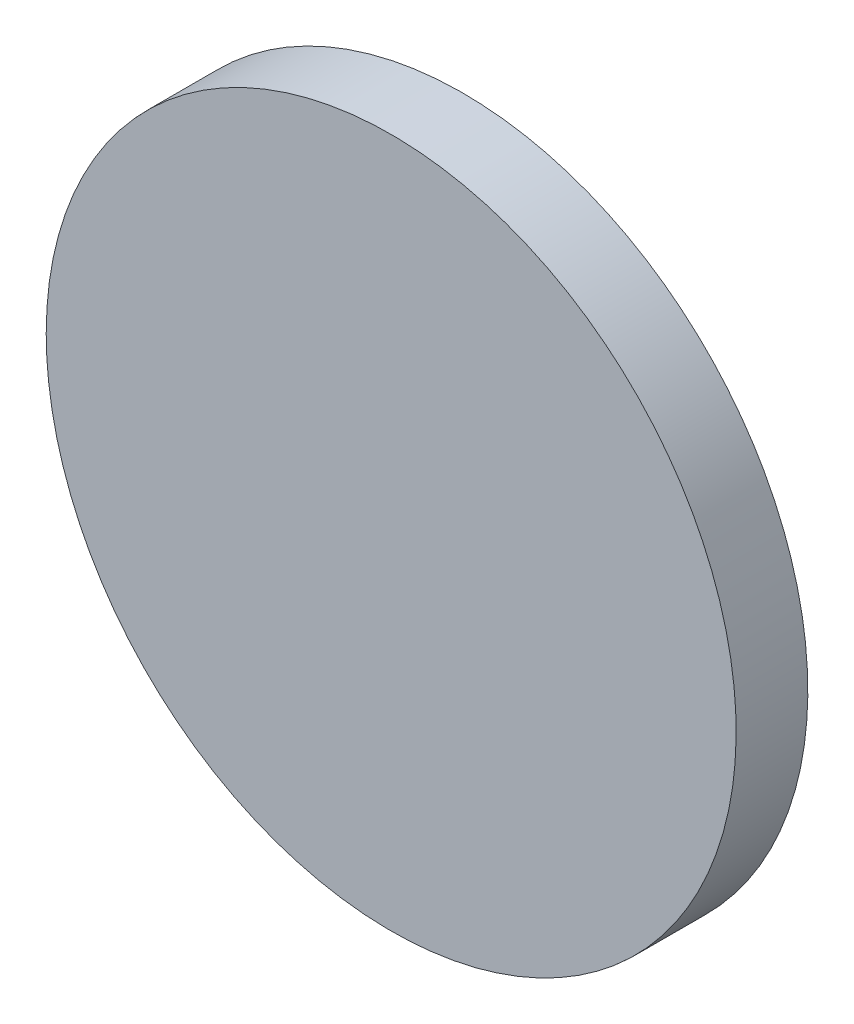
ISO-10303-21;
HEADER;
FILE_DESCRIPTION(('STEP AP214'),'2;1');
FILE_NAME('part.step','',(''),(''),'','','');
FILE_SCHEMA(('AUTOMOTIVE_DESIGN { 1 0 10303 214 1 1 1 1 }'));
ENDSEC;
DATA;
#1=APPLICATION_CONTEXT('core data for automotive mechanical design processes');
#2=APPLICATION_PROTOCOL_DEFINITION('international standard','automotive_design',2000,#1);
#3=PRODUCT_CONTEXT('',#1,'mechanical');
#4=PRODUCT('Part','Part','',(#3));
#5=PRODUCT_RELATED_PRODUCT_CATEGORY('part','',(#4));
#6=PRODUCT_DEFINITION_FORMATION('','',#4);
#7=PRODUCT_DEFINITION_CONTEXT('part definition',#1,'design');
#8=PRODUCT_DEFINITION('design','',#6,#7);
#9=PRODUCT_DEFINITION_SHAPE('','',#8);
#10=(LENGTH_UNIT() NAMED_UNIT(*) SI_UNIT(.MILLI.,.METRE.));
#11=(NAMED_UNIT(*) PLANE_ANGLE_UNIT() SI_UNIT($,.RADIAN.));
#12=(NAMED_UNIT(*) SI_UNIT($,.STERADIAN.) SOLID_ANGLE_UNIT());
#13=UNCERTAINTY_MEASURE_WITH_UNIT(LENGTH_MEASURE(1.E-05),#10,'distance_accuracy_value','');
#14=(GEOMETRIC_REPRESENTATION_CONTEXT(3) GLOBAL_UNCERTAINTY_ASSIGNED_CONTEXT((#13)) GLOBAL_UNIT_ASSIGNED_CONTEXT((#10,
#11,#12)) REPRESENTATION_CONTEXT('',''));
#15=CARTESIAN_POINT('',(0.,0.,0.));
#16=DIRECTION('',(0.,0.,1.));
#17=DIRECTION('',(1.,0.,0.));
#18=AXIS2_PLACEMENT_3D('',#15,#16,#17);
#19=CARTESIAN_POINT('',(-39.1301803038668,-4.71707895126184,92.5012));
#20=CARTESIAN_POINT('',(-39.1301803038668,-3.14225523024903,92.5012));
#21=CARTESIAN_POINT('',(-38.8199671072213,0.00739221177660808,92.5012));
#22=CARTESIAN_POINT('',(-37.4418897010833,4.55030459753344,92.5012));
#23=CARTESIAN_POINT('',(-35.2040134256585,8.73707663071864,92.5012));
#24=CARTESIAN_POINT('',(-32.192338611196,12.4068130100657,92.5012));
#25=CARTESIAN_POINT('',(-28.5226022318489,15.4184878245282,92.5012));
#26=CARTESIAN_POINT('',(-24.3358301986637,17.656364099953,92.5012));
#27=CARTESIAN_POINT('',(-19.7929178129069,19.0344415060911,92.5012));
#28=CARTESIAN_POINT('',(-15.0684466498684,19.4997613010592,92.5012));
#29=CARTESIAN_POINT('',(-10.34397548683,19.0344415060911,92.5012));
#30=CARTESIAN_POINT('',(-5.80106310107313,17.656364099953,92.5012));
#31=CARTESIAN_POINT('',(-1.61429106788792,15.4184878245282,92.5012));
#32=CARTESIAN_POINT('',(2.05544531145914,12.4068130100657,92.5012));
#33=CARTESIAN_POINT('',(5.06712012592165,8.73707663071865,92.5012));
#34=CARTESIAN_POINT('',(7.30499640134647,4.55030459753344,92.5012));
#35=CARTESIAN_POINT('',(8.68307380748453,0.00739221177661997,92.5012));
#36=CARTESIAN_POINT('',(9.14839360245264,-4.71707895126184,92.5012));
#37=CARTESIAN_POINT('',(8.68307380748453,-9.4415501143003,92.5012));
#38=CARTESIAN_POINT('',(7.30499640134648,-13.9844625000571,92.5012));
#39=CARTESIAN_POINT('',(5.06712012592165,-18.1712345332423,92.5012));
#40=CARTESIAN_POINT('',(2.05544531145915,-21.8409709125894,92.5012));
#41=CARTESIAN_POINT('',(-1.61429106788792,-24.8526457270519,92.5012));
#42=CARTESIAN_POINT('',(-5.80106310107311,-27.0905220024767,92.5012));
#43=CARTESIAN_POINT('',(-10.34397548683,-28.4685994086148,92.5012));
#44=CARTESIAN_POINT('',(-15.0684466498684,-28.9339192035829,92.5012));
#45=CARTESIAN_POINT('',(-19.7929178129069,-28.4685994086148,92.5012));
#46=CARTESIAN_POINT('',(-24.3358301986637,-27.0905220024767,92.5012));
#47=CARTESIAN_POINT('',(-28.5226022318489,-24.8526457270519,92.5012));
#48=CARTESIAN_POINT('',(-32.192338611196,-21.8409709125894,92.5012));
#49=CARTESIAN_POINT('',(-35.2040134256584,-18.1712345332423,92.5012));
#50=CARTESIAN_POINT('',(-37.4418897010833,-13.9844625000571,92.5012));
#51=CARTESIAN_POINT('',(-38.8199671072213,-9.44155011430031,92.5012));
#52=CARTESIAN_POINT('',(-39.1301803038668,-6.29190267227467,92.5012));
#53=CARTESIAN_POINT('',(-39.1301803038668,-4.71707895126184,92.5012));
#54=B_SPLINE_CURVE_WITH_KNOTS('',3,(#19,#20,#21,#22,#23,#24,#25,#26,#27,#28,#29,#30,#31,#32,#33,
#34,#35,#36,#37,#38,#39,#40,#41,#42,#43,#44,#45,#46,#47,#48,#49,#50,#51,#52,#53),.UNSPECIFIED.,
.T.,.F.,(4,1,1,1,1,1,1,1,1,1,1,1,1,1,1,1,1,1,1,1,1,1,1,1,1,1,1,1,1,1,1,1,4),(0.,0.03125,0.0625,
0.09375,0.125,0.15625,0.1875,0.21875,0.25,0.28125,0.3125,0.34375,0.375,0.40625,0.4375,0.46875,
0.5,0.53125,0.5625,0.59375,0.625,0.65625,0.6875,0.71875,0.75,0.78125,0.8125,0.84375,0.875,
0.90625,0.9375,0.96875,1.),.UNSPECIFIED.);
#55=DIRECTION('',(0.,0.,-1.));
#56=VECTOR('',#55,1.);
#57=SURFACE_OF_LINEAR_EXTRUSION('',#54,#56);
#58=CARTESIAN_POINT('',(-39.1301803038668,-4.71707895126184,92.5012));
#59=CARTESIAN_POINT('',(-39.1301803038668,-3.14225523024903,92.5012));
#60=CARTESIAN_POINT('',(-38.8199671072213,0.00739221177660808,92.5012));
#61=CARTESIAN_POINT('',(-37.4418897010833,4.55030459753344,92.5012));
#62=CARTESIAN_POINT('',(-35.2040134256585,8.73707663071864,92.5012));
#63=CARTESIAN_POINT('',(-32.192338611196,12.4068130100657,92.5012));
#64=CARTESIAN_POINT('',(-28.5226022318489,15.4184878245282,92.5012));
#65=CARTESIAN_POINT('',(-24.3358301986637,17.656364099953,92.5012));
#66=CARTESIAN_POINT('',(-19.7929178129069,19.0344415060911,92.5012));
#67=CARTESIAN_POINT('',(-15.0684466498684,19.4997613010592,92.5012));
#68=CARTESIAN_POINT('',(-10.34397548683,19.0344415060911,92.5012));
#69=CARTESIAN_POINT('',(-5.80106310107313,17.656364099953,92.5012));
#70=CARTESIAN_POINT('',(-1.61429106788792,15.4184878245282,92.5012));
#71=CARTESIAN_POINT('',(2.05544531145914,12.4068130100657,92.5012));
#72=CARTESIAN_POINT('',(5.06712012592165,8.73707663071865,92.5012));
#73=CARTESIAN_POINT('',(7.30499640134647,4.55030459753344,92.5012));
#74=CARTESIAN_POINT('',(8.68307380748453,0.00739221177661997,92.5012));
#75=CARTESIAN_POINT('',(9.14839360245264,-4.71707895126184,92.5012));
#76=CARTESIAN_POINT('',(8.68307380748453,-9.4415501143003,92.5012));
#77=CARTESIAN_POINT('',(7.30499640134648,-13.9844625000571,92.5012));
#78=CARTESIAN_POINT('',(5.06712012592165,-18.1712345332423,92.5012));
#79=CARTESIAN_POINT('',(2.05544531145915,-21.8409709125894,92.5012));
#80=CARTESIAN_POINT('',(-1.61429106788792,-24.8526457270519,92.5012));
#81=CARTESIAN_POINT('',(-5.80106310107311,-27.0905220024767,92.5012));
#82=CARTESIAN_POINT('',(-10.34397548683,-28.4685994086148,92.5012));
#83=CARTESIAN_POINT('',(-15.0684466498684,-28.9339192035829,92.5012));
#84=CARTESIAN_POINT('',(-19.7929178129069,-28.4685994086148,92.5012));
#85=CARTESIAN_POINT('',(-24.3358301986637,-27.0905220024767,92.5012));
#86=CARTESIAN_POINT('',(-28.5226022318489,-24.8526457270519,92.5012));
#87=CARTESIAN_POINT('',(-32.192338611196,-21.8409709125894,92.5012));
#88=CARTESIAN_POINT('',(-35.2040134256584,-18.1712345332423,92.5011999999999));
#89=CARTESIAN_POINT('',(-37.4418897010833,-13.9844625000571,92.5012));
#90=CARTESIAN_POINT('',(-38.8199671072213,-9.44155011430031,92.5012));
#91=CARTESIAN_POINT('',(-39.1301803038668,-6.29190267227467,92.5012));
#92=CARTESIAN_POINT('',(-39.1301803038668,-4.71707895126184,92.5012));
#93=B_SPLINE_CURVE_WITH_KNOTS('',3,(#58,#59,#60,#61,#62,#63,#64,#65,#66,#67,#68,#69,#70,#71,#72,
#73,#74,#75,#76,#77,#78,#79,#80,#81,#82,#83,#84,#85,#86,#87,#88,#89,#90,#91,#92),.UNSPECIFIED.,
.T.,.F.,(4,1,1,1,1,1,1,1,1,1,1,1,1,1,1,1,1,1,1,1,1,1,1,1,1,1,1,1,1,1,1,1,4),(0.,0.03125,0.0625,
0.09375,0.125,0.15625,0.1875,0.21875,0.25,0.28125,0.3125,0.34375,0.375,0.40625,0.4375,0.46875,
0.5,0.53125,0.5625,0.59375,0.625,0.65625,0.6875,0.71875,0.75,0.78125,0.8125,0.84375,0.875,
0.90625,0.9375,0.96875,1.),.UNSPECIFIED.);
#94=CARTESIAN_POINT('',(-39.1301803038668,-4.71707895126184,92.5012));
#95=VERTEX_POINT('',#94);
#96=EDGE_CURVE('E10',#95,#95,#93,.T.);
#97=ORIENTED_EDGE('',*,*,#96,.T.);
#98=EDGE_LOOP('',(#97));
#99=FACE_BOUND('',#98,.T.);
#100=CARTESIAN_POINT('',(-39.1301803038668,-4.71707895126184,87.5012));
#101=CARTESIAN_POINT('',(-39.1301802222032,-5.1107872990119,87.5012));
#102=CARTESIAN_POINT('',(-39.1204860256992,-5.50449278140269,87.5012));
#103=CARTESIAN_POINT('',(-39.0818025927257,-6.29095813858405,87.5012));
#104=CARTESIAN_POINT('',(-39.0528132063749,-6.68371800600549,87.5012));
#105=CARTESIAN_POINT('',(-38.9756325863231,-7.46734611050324,87.5012));
#106=CARTESIAN_POINT('',(-38.9274413526221,-7.85821434757955,87.5012));
#107=CARTESIAN_POINT('',(-38.8119495875981,-8.63711557124963,87.5012));
#108=CARTESIAN_POINT('',(-38.7446492047158,-9.02514857984355,87.5012));
#109=CARTESIAN_POINT('',(-38.5910324726703,-9.79743205632982,87.5012));
#110=CARTESIAN_POINT('',(-38.5047161235071,-10.1816825242222,87.5012));
#111=CARTESIAN_POINT('',(-38.3133439864091,-10.9454902631069,87.5012));
#112=CARTESIAN_POINT('',(-38.2082880529137,-11.3250474976198,87.5012));
#113=CARTESIAN_POINT('',(-37.9797122353719,-12.0785609863271,87.5012));
#114=CARTESIAN_POINT('',(-37.8561923513257,-12.4525172405214,87.5012));
#115=CARTESIAN_POINT('',(-37.5909636221545,-13.1939208314435,87.5012));
#116=CARTESIAN_POINT('',(-37.4492549183258,-13.5613682187089,87.5012));
#117=CARTESIAN_POINT('',(-37.1479248607452,-14.2888433305481,87.5012));
#118=CARTESIAN_POINT('',(-36.9883035069933,-14.6488710551219,87.5012));
#119=CARTESIAN_POINT('',(-36.6515970329992,-15.3606675950413,87.5012));
#120=CARTESIAN_POINT('',(-36.4745117771101,-15.7124363462109,87.5012));
#121=CARTESIAN_POINT('',(-36.1033247909515,-16.4068783534881,87.5012));
#122=CARTESIAN_POINT('',(-35.909223060682,-16.7495516095956,87.5012));
#123=CARTESIAN_POINT('',(-35.5044499617942,-17.4249657805452,87.5012));
#124=CARTESIAN_POINT('',(-35.2937787218976,-17.7577067725192,87.5011999999999));
#125=CARTESIAN_POINT('',(-34.8563152830734,-18.4124170760193,87.5011999999999));
#126=CARTESIAN_POINT('',(-34.6295230841459,-18.7343863875453,87.5012));
#127=CARTESIAN_POINT('',(-34.1604217144475,-19.3668177821266,87.5012));
#128=CARTESIAN_POINT('',(-33.9181124231562,-19.6772797757756,87.5012));
#129=CARTESIAN_POINT('',(-33.4185787760349,-20.2859632859427,87.5012));
#130=CARTESIAN_POINT('',(-33.1613544202049,-20.5841848024609,87.5012));
#131=CARTESIAN_POINT('',(-32.6325921548073,-21.1676537653001,87.5012));
#132=CARTESIAN_POINT('',(-32.3610543564404,-21.4529013123835,87.5012));
#133=CARTESIAN_POINT('',(-31.8042690109901,-22.0096866578338,87.5012));
#134=CARTESIAN_POINT('',(-31.5190214639067,-22.2812244562007,87.5012));
#135=CARTESIAN_POINT('',(-30.9355525010675,-22.8099867215983,87.5012));
#136=CARTESIAN_POINT('',(-30.6373309845493,-23.0672110774283,87.5012));
#137=CARTESIAN_POINT('',(-30.0286474743822,-23.5667447245496,87.5012));
#138=CARTESIAN_POINT('',(-29.7181854807333,-23.8090540158409,87.5012));
#139=CARTESIAN_POINT('',(-29.0857540861519,-24.2781553855393,87.5012));
#140=CARTESIAN_POINT('',(-28.7637847746257,-24.5049475844669,87.5012));
#141=CARTESIAN_POINT('',(-28.1090744711261,-24.942411023291,87.5012));
#142=CARTESIAN_POINT('',(-27.7763334791526,-25.1530822631876,87.5012));
#143=CARTESIAN_POINT('',(-27.1009193082014,-25.5578553620755,87.5012));
#144=CARTESIAN_POINT('',(-26.7582460520915,-25.7519570923451,87.5012));
#145=CARTESIAN_POINT('',(-26.0638040448207,-26.1231440785033,87.5012));
#146=CARTESIAN_POINT('',(-25.7120352936597,-26.3002293343921,87.5012));
#147=CARTESIAN_POINT('',(-25.0002387537167,-26.6369358083873,87.5012));
#148=CARTESIAN_POINT('',(-24.6402110291108,-26.7965571621408,87.5012));
#149=CARTESIAN_POINT('',(-23.9127359173595,-27.097887219717,87.5012));
#150=CARTESIAN_POINT('',(-23.5452885302142,-27.2395959235398,87.5012));
#151=CARTESIAN_POINT('',(-22.803884938964,-27.5048246527272,87.5012));
#152=CARTESIAN_POINT('',(-22.4299286843214,-27.6283445367956,87.5012));
#153=CARTESIAN_POINT('',(-21.6764151968387,-27.8569203542769,87.5012));
#154=CARTESIAN_POINT('',(-21.2968579639985,-27.9619762876898,87.5012));
#155=CARTESIAN_POINT('',(-20.5330502205438,-28.1533484250133,87.5012));
#156=CARTESIAN_POINT('',(-20.1487997464088,-28.2396647744847,87.5012));
#157=CARTESIAN_POINT('',(-19.3765162869778,-28.3932815056882,87.5012));
#158=CARTESIAN_POINT('',(-18.9884833016818,-28.4605818874205,87.5012));
#159=CARTESIAN_POINT('',(-18.2095820143604,-28.5760736555866,87.5012));
#160=CARTESIAN_POINT('',(-17.8187136903339,-28.6242648935798,87.5012));
#161=CARTESIAN_POINT('',(-17.035085823388,-28.7014455019051,87.5012));
#162=CARTESIAN_POINT('',(-16.6423262804685,-28.7304348722371,87.5012));
#163=CARTESIAN_POINT('',(-15.8558600367348,-28.7691183489744,87.5012));
#164=CARTESIAN_POINT('',(-15.4621533433016,-28.7788126052602,87.5012));
#165=CARTESIAN_POINT('',(-14.6747399564352,-28.7788126052602,87.5012));
#166=CARTESIAN_POINT('',(-14.281033263002,-28.7691183489744,87.5012));
#167=CARTESIAN_POINT('',(-13.4945670192683,-28.7304348722371,87.5012));
#168=CARTESIAN_POINT('',(-13.1018074763489,-28.7014455019051,87.5012));
#169=CARTESIAN_POINT('',(-12.318179609403,-28.6242648935798,87.5012));
#170=CARTESIAN_POINT('',(-11.9273112853765,-28.5760736555866,87.5012));
#171=CARTESIAN_POINT('',(-11.1484099980551,-28.4605818874205,87.5012));
#172=CARTESIAN_POINT('',(-10.7603770127591,-28.3932815056882,87.5012));
#173=CARTESIAN_POINT('',(-9.98809355332808,-28.2396647744847,87.5012));
#174=CARTESIAN_POINT('',(-9.60384307919307,-28.1533484250133,87.5012));
#175=CARTESIAN_POINT('',(-8.8400353357384,-27.9619762876898,87.5012));
#176=CARTESIAN_POINT('',(-8.46047810289821,-27.8569203542769,87.5012));
#177=CARTESIAN_POINT('',(-7.70696461541547,-27.6283445367956,87.5012));
#178=CARTESIAN_POINT('',(-7.33300836077292,-27.5048246527272,87.5012));
#179=CARTESIAN_POINT('',(-6.59160476952266,-27.2395959235398,87.5012));
#180=CARTESIAN_POINT('',(-6.22415738237737,-27.0978872197171,87.5012));
#181=CARTESIAN_POINT('',(-5.49668227062612,-26.7965571621408,87.5012));
#182=CARTESIAN_POINT('',(-5.13665454602016,-26.6369358083873,87.5012));
#183=CARTESIAN_POINT('',(-4.42485800607718,-26.3002293343921,87.5012));
#184=CARTESIAN_POINT('',(-4.07308925491617,-26.1231440785034,87.5012));
#185=CARTESIAN_POINT('',(-3.37864724764532,-25.7519570923451,87.5012));
#186=CARTESIAN_POINT('',(-3.03597399153548,-25.5578553620755,87.5012));
#187=CARTESIAN_POINT('',(-2.36055982058423,-25.1530822631876,87.5012));
#188=CARTESIAN_POINT('',(-2.02781882861078,-24.942411023291,87.5012));
#189=CARTESIAN_POINT('',(-1.37310852511114,-24.5049475844669,87.5012));
#190=CARTESIAN_POINT('',(-1.05113921358496,-24.2781553855394,87.5012));
#191=CARTESIAN_POINT('',(-0.418707819003584,-23.8090540158409,87.5012));
#192=CARTESIAN_POINT('',(-0.108245825354678,-23.5667447245496,87.5012));
#193=CARTESIAN_POINT('',(0.500437684812428,-23.0672110774283,87.5012));
#194=CARTESIAN_POINT('',(0.798659201330628,-22.8099867215983,87.5012));
#195=CARTESIAN_POINT('',(1.38212816416985,-22.2812244562007,87.5012));
#196=CARTESIAN_POINT('',(1.66737571125323,-22.0096866578338,87.5012));
#197=CARTESIAN_POINT('',(2.22416105670352,-21.4529013123835,87.5012));
#198=CARTESIAN_POINT('',(2.49569885507044,-21.1676537653001,87.5012));
#199=CARTESIAN_POINT('',(3.02446112046807,-20.5841848024609,87.5012));
#200=CARTESIAN_POINT('',(3.28168547629803,-20.2859632859427,87.5012));
#201=CARTESIAN_POINT('',(3.78121912341932,-19.6772797757756,87.5012));
#202=CARTESIAN_POINT('',(4.02352841471064,-19.3668177821267,87.5012));
#203=CARTESIAN_POINT('',(4.49262978440909,-18.7343863875453,87.5012));
#204=CARTESIAN_POINT('',(4.71942198333663,-18.4124170760191,87.5012));
#205=CARTESIAN_POINT('',(5.15688542216075,-17.7577067725195,87.5012));
#206=CARTESIAN_POINT('',(5.36755666205732,-17.424965780546,87.5012));
#207=CARTESIAN_POINT('',(5.77232976094526,-16.7495516095948,87.5012));
#208=CARTESIAN_POINT('',(5.96643149121482,-16.406878353485,87.5012));
#209=CARTESIAN_POINT('',(6.33761847737311,-15.7124363462141,87.5011999999999));
#210=CARTESIAN_POINT('',(6.51470373326184,-15.3606675950531,87.5012));
#211=CARTESIAN_POINT('',(6.85141020725708,-14.6488710551101,87.5012));
#212=CARTESIAN_POINT('',(7.01103156101055,-14.2888433305042,87.5012));
#213=CARTESIAN_POINT('',(7.3123616185868,-13.5613682187529,87.5012));
#214=CARTESIAN_POINT('',(7.45407032240959,-13.1939208316076,87.5012));
#215=CARTESIAN_POINT('',(7.71929905159694,-12.4525172403574,87.5012));
#216=CARTESIAN_POINT('',(7.84281893566533,-12.0785609857148,87.5012));
#217=CARTESIAN_POINT('',(8.07139475314662,-11.3250474982321,87.5012));
#218=CARTESIAN_POINT('',(8.17645068655952,-10.9454902653919,87.5012));
#219=CARTESIAN_POINT('',(8.36782282388309,-10.1816825219372,87.5012));
#220=CARTESIAN_POINT('',(8.45413917335441,-9.79743204780222,87.5012));
#221=CARTESIAN_POINT('',(8.60775590455799,-9.0251485883712,87.5012));
#222=CARTESIAN_POINT('',(8.67505628629024,-8.6371156030752,87.5012));
#223=CARTESIAN_POINT('',(8.79054805445632,-7.85821431575377,87.5012));
#224=CARTESIAN_POINT('',(8.83873929244956,-7.46734599172733,87.5012));
#225=CARTESIAN_POINT('',(8.91591990077484,-6.68371812478143,87.5012));
#226=CARTESIAN_POINT('',(8.94490927110689,-6.29095858186197,87.5012));
#227=CARTESIAN_POINT('',(8.98359274784417,-5.50449233812825,87.5012));
#228=CARTESIAN_POINT('',(8.99328700412993,-5.11078564469505,87.5012));
#229=CARTESIAN_POINT('',(8.99328700412994,-4.32337225782866,87.5012));
#230=CARTESIAN_POINT('',(8.98359274784417,-3.92966556439546,87.5012));
#231=CARTESIAN_POINT('',(8.94490927110689,-3.14319932066174,87.5012));
#232=CARTESIAN_POINT('',(8.91591990077485,-2.75043977774228,87.5012));
#233=CARTESIAN_POINT('',(8.83873929244957,-1.96681191079638,87.5012));
#234=CARTESIAN_POINT('',(8.79054805445633,-1.57594358676994,87.5012));
#235=CARTESIAN_POINT('',(8.67505628629024,-0.797042299448513,87.5012));
#236=CARTESIAN_POINT('',(8.60775590455799,-0.40900931415251,87.5012));
#237=CARTESIAN_POINT('',(8.45413917335442,0.363274145278503,87.5012));
#238=CARTESIAN_POINT('',(8.3678228238831,0.747524619413512,87.5012));
#239=CARTESIAN_POINT('',(8.17645068655953,1.51133236286818,87.5012));
#240=CARTESIAN_POINT('',(8.07139475314664,1.89088959570837,87.5012));
#241=CARTESIAN_POINT('',(7.84281893566534,2.64440308319111,87.5012));
#242=CARTESIAN_POINT('',(7.71929905159694,3.01835933783366,87.5012));
#243=CARTESIAN_POINT('',(7.45407032240959,3.75976292908391,87.5012));
#244=CARTESIAN_POINT('',(7.31236161858681,4.1272103162292,87.5012));
#245=CARTESIAN_POINT('',(7.01103156101056,4.85468542798045,87.5012));
#246=CARTESIAN_POINT('',(6.85141020725709,5.21471315258641,87.5012));
#247=CARTESIAN_POINT('',(6.51470373326185,5.92650969252939,87.5012));
#248=CARTESIAN_POINT('',(6.33761847737312,6.2782784436904,87.5012));
#249=CARTESIAN_POINT('',(5.96643149121483,6.97272045096125,87.5012));
#250=CARTESIAN_POINT('',(5.77232976094527,7.31539370707109,87.5012));
#251=CARTESIAN_POINT('',(5.36755666205734,7.99080787802234,87.5012));
#252=CARTESIAN_POINT('',(5.15688542216077,8.3235488699958,87.5012));
#253=CARTESIAN_POINT('',(4.71942198333665,8.97825917349543,87.5012));
#254=CARTESIAN_POINT('',(4.4926297844091,9.30022848502161,87.5012));
#255=CARTESIAN_POINT('',(4.02352841471065,9.93265987960299,87.5012));
#256=CARTESIAN_POINT('',(3.78121912341933,10.2431218732519,87.5012));
#257=CARTESIAN_POINT('',(3.28168547629804,10.851805383419,87.5012));
#258=CARTESIAN_POINT('',(3.02446112046808,11.1500268999372,87.5012));
#259=CARTESIAN_POINT('',(2.49569885507045,11.7334958627764,87.5012));
#260=CARTESIAN_POINT('',(2.22416105670353,12.0187434098598,87.5012));
#261=CARTESIAN_POINT('',(1.66737571125324,12.5755287553101,87.5012));
#262=CARTESIAN_POINT('',(1.38212816416987,12.847066553677,87.5012));
#263=CARTESIAN_POINT('',(0.798659201330642,13.3758288190746,87.5012));
#264=CARTESIAN_POINT('',(0.500437684812445,13.6330531749046,87.5012));
#265=CARTESIAN_POINT('',(-0.108245825354659,14.1325868220259,87.5012));
#266=CARTESIAN_POINT('',(-0.418707819003565,14.3748961133172,87.5012));
#267=CARTESIAN_POINT('',(-1.05113921358494,14.8439974830157,87.5012));
#268=CARTESIAN_POINT('',(-1.37310852511112,15.0707896819432,87.5012));
#269=CARTESIAN_POINT('',(-2.02781882861075,15.5082531207673,87.5011999999999));
#270=CARTESIAN_POINT('',(-2.36055982058421,15.7189243606639,87.5011999999999));
#271=CARTESIAN_POINT('',(-3.03597399153546,16.1236974595518,87.5011999999999));
#272=CARTESIAN_POINT('',(-3.3786472476453,16.3177991898214,87.5011999999999));
#273=CARTESIAN_POINT('',(-4.07308925491614,16.6889861759797,87.5012));
#274=CARTESIAN_POINT('',(-4.42485800607716,16.8660714318684,87.5012));
#275=CARTESIAN_POINT('',(-5.13665454602014,17.2027779058636,87.5012));
#276=CARTESIAN_POINT('',(-5.4966822706261,17.3623992596171,87.5012));
#277=CARTESIAN_POINT('',(-6.22415738237735,17.6637293171934,87.5012));
#278=CARTESIAN_POINT('',(-6.59160476952264,17.8054380210162,87.5012));
#279=CARTESIAN_POINT('',(-7.33300836077289,18.0706667502035,87.5012));
#280=CARTESIAN_POINT('',(-7.70696461541544,18.1941866342719,87.5012));
#281=CARTESIAN_POINT('',(-8.46047810289818,18.4227624517532,87.5012));
#282=CARTESIAN_POINT('',(-8.84003533573837,18.5278183851661,87.5012));
#283=CARTESIAN_POINT('',(-9.60384307919304,18.7191905224897,87.5012));
#284=CARTESIAN_POINT('',(-9.98809355332805,18.805506871961,87.5012));
#285=CARTESIAN_POINT('',(-10.7603770127591,18.9591236031646,87.5012));
#286=CARTESIAN_POINT('',(-11.1484099980551,19.0264239848968,87.5012));
#287=CARTESIAN_POINT('',(-11.9273112853765,19.1419157530629,87.5012));
#288=CARTESIAN_POINT('',(-12.3181796094029,19.1901069910561,87.5012));
#289=CARTESIAN_POINT('',(-13.1018074763488,19.2672875993814,87.5012));
#290=CARTESIAN_POINT('',(-13.4945670192683,19.2962769697135,87.5012));
#291=CARTESIAN_POINT('',(-14.281033263002,19.3349604464507,87.5012));
#292=CARTESIAN_POINT('',(-14.6747399564352,19.3446547027365,87.5012));
#293=CARTESIAN_POINT('',(-15.4621533433016,19.3446547027365,87.5012));
#294=CARTESIAN_POINT('',(-15.8558600367348,19.3349604464507,87.5012));
#295=CARTESIAN_POINT('',(-16.6423262804685,19.2962769697135,87.5012));
#296=CARTESIAN_POINT('',(-17.035085823388,19.2672875993814,87.5012));
#297=CARTESIAN_POINT('',(-17.8187136903339,19.1901069910561,87.5012));
#298=CARTESIAN_POINT('',(-18.2095820143603,19.1419157530629,87.5012));
#299=CARTESIAN_POINT('',(-18.9884833016817,19.0264239848968,87.5012));
#300=CARTESIAN_POINT('',(-19.3765162869778,18.9591236031646,87.5012));
#301=CARTESIAN_POINT('',(-20.1487997464088,18.805506871961,87.5012));
#302=CARTESIAN_POINT('',(-20.5330502205438,18.7191905224897,87.5012));
#303=CARTESIAN_POINT('',(-21.2968579639984,18.5278183851661,87.5012));
#304=CARTESIAN_POINT('',(-21.6764151968386,18.4227624517532,87.5012));
#305=CARTESIAN_POINT('',(-22.4299286843214,18.1941866342719,87.5012));
#306=CARTESIAN_POINT('',(-22.8038849389639,18.0706667502035,87.5012));
#307=CARTESIAN_POINT('',(-23.5452885302142,17.8054380210162,87.5012));
#308=CARTESIAN_POINT('',(-23.9127359173595,17.6637293171934,87.5012));
#309=CARTESIAN_POINT('',(-24.6402110291107,17.3623992596171,87.5012));
#310=CARTESIAN_POINT('',(-25.0002387537167,17.2027779058637,87.5012));
#311=CARTESIAN_POINT('',(-25.7120352936597,16.8660714318684,87.5012));
#312=CARTESIAN_POINT('',(-26.0638040448207,16.6889861759797,87.5012));
#313=CARTESIAN_POINT('',(-26.7582460520915,16.3177991898214,87.5012));
#314=CARTESIAN_POINT('',(-27.1009193082014,16.1236974595518,87.5012));
#315=CARTESIAN_POINT('',(-27.7763334791526,15.7189243606639,87.5012));
#316=CARTESIAN_POINT('',(-28.1090744711261,15.5082531207673,87.5012));
#317=CARTESIAN_POINT('',(-28.7637847746257,15.0707896819432,87.5012));
#318=CARTESIAN_POINT('',(-29.0857540861519,14.8439974830157,87.5012));
#319=CARTESIAN_POINT('',(-29.7181854807332,14.3748961133172,87.5012));
#320=CARTESIAN_POINT('',(-30.0286474743822,14.1325868220259,87.5012));
#321=CARTESIAN_POINT('',(-30.6373309845493,13.6330531749046,87.5012));
#322=CARTESIAN_POINT('',(-30.9355525010675,13.3758288190746,87.5012));
#323=CARTESIAN_POINT('',(-31.5190214639067,12.847066553677,87.5012));
#324=CARTESIAN_POINT('',(-31.8042690109901,12.5755287553101,87.5012));
#325=CARTESIAN_POINT('',(-32.3610543564404,12.0187434098598,87.5012));
#326=CARTESIAN_POINT('',(-32.6325921548073,11.7334958627764,87.5012));
#327=CARTESIAN_POINT('',(-33.1613544202049,11.1500268999372,87.5012));
#328=CARTESIAN_POINT('',(-33.4185787760349,10.851805383419,87.5012));
#329=CARTESIAN_POINT('',(-33.9181124231561,10.2431218732519,87.5012));
#330=CARTESIAN_POINT('',(-34.1604217144475,9.93265987960294,87.5012));
#331=CARTESIAN_POINT('',(-34.6295230841459,9.30022848502168,87.5012));
#332=CARTESIAN_POINT('',(-34.8563152830734,8.97825917349567,87.5012));
#333=CARTESIAN_POINT('',(-35.2937787218976,8.32354886999558,87.5012));
#334=CARTESIAN_POINT('',(-35.5044499617942,7.99080787802151,87.5012));
#335=CARTESIAN_POINT('',(-35.909223060682,7.31539370707195,87.5012));
#336=CARTESIAN_POINT('',(-36.1033247909515,6.97272045096442,87.5012));
#337=CARTESIAN_POINT('',(-36.4745117771101,6.27827844368726,87.5012));
#338=CARTESIAN_POINT('',(-36.6515970329992,5.92650969251762,87.5012));
#339=CARTESIAN_POINT('',(-36.9883035069933,5.2147131525982,87.5012));
#340=CARTESIAN_POINT('',(-37.1479248607452,4.85468542802442,87.5012));
#341=CARTESIAN_POINT('',(-37.4492549183258,4.12721031618525,87.5012));
#342=CARTESIAN_POINT('',(-37.5909636221545,3.75976292891987,87.5012));
#343=CARTESIAN_POINT('',(-37.8561923513256,3.01835933799772,87.5012));
#344=CARTESIAN_POINT('',(-37.9797122353719,2.64440308380338,87.5012));
#345=CARTESIAN_POINT('',(-38.2082880529137,1.89088959509612,87.5012));
#346=CARTESIAN_POINT('',(-38.3133439864091,1.51133236058319,87.5012));
#347=CARTESIAN_POINT('',(-38.5047161235071,0.747524621698501,87.5012));
#348=CARTESIAN_POINT('',(-38.5910324726703,0.363274153806145,87.5012));
#349=CARTESIAN_POINT('',(-38.7446492047158,-0.409009322680134,87.5012));
#350=CARTESIAN_POINT('',(-38.8119495875981,-0.797042331274057,87.5012));
#351=CARTESIAN_POINT('',(-38.9274413526221,-1.57594355494414,87.5012));
#352=CARTESIAN_POINT('',(-38.9756325863231,-1.96681179202044,87.5012));
#353=CARTESIAN_POINT('',(-39.0528132063749,-2.75043989651819,87.5012));
#354=CARTESIAN_POINT('',(-39.0818025927257,-3.14319976393963,87.5012));
#355=CARTESIAN_POINT('',(-39.1204860256992,-3.92966512112099,87.5012));
#356=CARTESIAN_POINT('',(-39.1301802222032,-4.32337060351179,87.5012));
#357=CARTESIAN_POINT('',(-39.1301803038668,-4.71707895126184,87.5012));
#358=B_SPLINE_CURVE_WITH_KNOTS('',3,(#100,#101,#102,#103,#104,#105,#106,#107,#108,#109,#110,
#111,#112,#113,#114,#115,#116,#117,#118,#119,#120,#121,#122,#123,#124,#125,#126,#127,#128,#129,
#130,#131,#132,#133,#134,#135,#136,#137,#138,#139,#140,#141,#142,#143,#144,#145,#146,#147,#148,
#149,#150,#151,#152,#153,#154,#155,#156,#157,#158,#159,#160,#161,#162,#163,#164,#165,#166,#167,
#168,#169,#170,#171,#172,#173,#174,#175,#176,#177,#178,#179,#180,#181,#182,#183,#184,#185,#186,
#187,#188,#189,#190,#191,#192,#193,#194,#195,#196,#197,#198,#199,#200,#201,#202,#203,#204,#205,
#206,#207,#208,#209,#210,#211,#212,#213,#214,#215,#216,#217,#218,#219,#220,#221,#222,#223,#224,
#225,#226,#227,#228,#229,#230,#231,#232,#233,#234,#235,#236,#237,#238,#239,#240,#241,#242,#243,
#244,#245,#246,#247,#248,#249,#250,#251,#252,#253,#254,#255,#256,#257,#258,#259,#260,#261,#262,
#263,#264,#265,#266,#267,#268,#269,#270,#271,#272,#273,#274,#275,#276,#277,#278,#279,#280,#281,
#282,#283,#284,#285,#286,#287,#288,#289,#290,#291,#292,#293,#294,#295,#296,#297,#298,#299,#300,
#301,#302,#303,#304,#305,#306,#307,#308,#309,#310,#311,#312,#313,#314,#315,#316,#317,#318,#319,
#320,#321,#322,#323,#324,#325,#326,#327,#328,#329,#330,#331,#332,#333,#334,#335,#336,#337,#338,
#339,#340,#341,#342,#343,#344,#345,#346,#347,#348,#349,#350,#351,#352,#353,#354,#355,#356,#357),
.UNSPECIFIED.,.F.,.F.,(4,2,2,2,2,2,2,2,2,2,2,2,2,2,2,2,2,2,2,2,2,2,2,2,2,2,2,2,2,2,2,2,2,2,2,2,
2,2,2,2,2,2,2,2,2,2,2,2,2,2,2,2,2,2,2,2,2,2,2,2,2,2,2,2,2,2,2,2,2,2,2,2,2,2,2,2,2,2,2,2,2,2,2,2,
2,2,2,2,2,2,2,2,2,2,2,2,2,2,2,2,2,2,2,2,2,2,2,2,2,2,2,2,2,2,2,2,2,2,2,2,2,2,2,2,2,2,2,2,4),(0.,
1.18100197156121,2.36201311701337,3.54302426246554,4.72402623402674,5.90502820558795,
7.08603935104011,8.26705049649227,9.44805246805348,10.6290544396147,11.8100655850669,
12.991076730519,14.1720787020802,15.3530806736414,16.5340918190936,17.7151029645458,
18.896104936107,20.0771069076682,21.2581180531203,22.4391291985725,23.6201311701337,
24.8011331416949,25.9821442871471,27.1631554325992,28.3441574041604,29.5251593757217,
30.7061705211738,31.887181666626,33.0681836381872,34.2491856097484,35.4301967552006,
36.6112079006528,37.792209872214,38.9732118437752,40.1542229892273,41.3352341346795,
42.5162361062407,43.6972380778019,44.8782492232541,46.0592603687063,47.2402623402675,
48.4212643118287,49.6022754572809,50.783286602733,51.9642885742942,53.1452905458554,
54.3263016913076,55.5073128367598,56.688314808321,57.8693167798822,59.0503279253344,
60.2313390707865,61.4123410423477,62.5933430139089,63.7743541593611,64.9553653048133,
66.1363672763745,67.3173692479357,68.4983803933878,69.67939153884,70.8603935104012,
72.0413954819624,73.2224066274146,74.4034177728667,75.5844197444279,76.7654217159891,
77.9464328614413,79.1274440068935,80.3084459784547,81.4894479500159,82.670459095468,
83.8514702409202,85.0324722124814,86.2134741840426,87.3944853294948,88.5754964749469,
89.7564984465081,90.9375004180693,92.1185115635215,93.2995227089737,94.4805246805349,
95.6615266520961,96.8425377975483,98.0235489430004,99.2045509145616,100.385552886123,
101.566564031575,102.747575177027,103.928577148588,105.10957912015,106.290590265602,
107.471601411054,108.652603382615,109.833605354176,111.014616499628,112.195627645081,
113.376629616642,114.557631588203,115.738642733655,116.919653879107,118.100655850669,
119.28165782223,120.462668967682,121.643680113134,122.824682084695,124.005684056257,
125.186695201709,126.367706347161,127.548708318722,128.729710290283,129.910721435735,
131.091732581188,132.272734552749,133.45373652431,134.634747669762,135.815758815214,
136.996760786776,138.177762758337,139.358773903789,140.539785049241,141.720787020802,
142.901788992363,144.082800137816,145.263811283268,146.444813254829,147.62581522639,
148.806826371842,149.987837517295,151.168839488856),.UNSPECIFIED.);
#359=CARTESIAN_POINT('',(-39.1301803038668,-4.71707895126184,87.5012));
#360=VERTEX_POINT('',#359);
#361=EDGE_CURVE('E25',#360,#360,#358,.F.);
#362=ORIENTED_EDGE('',*,*,#361,.F.);
#363=EDGE_LOOP('',(#362));
#364=FACE_BOUND('',#363,.T.);
#365=ADVANCED_FACE('F15',(#99,#364),#57,.T.);
#366=CARTESIAN_POINT('',(8.33155335013119,-4.71707895126205,92.5012));
#367=DIRECTION('',(0.,0.,-1.));
#368=DIRECTION('',(0.,1.,0.));
#369=AXIS2_PLACEMENT_3D('',#366,#367,#368);
#370=PLANE('',#369);
#371=ORIENTED_EDGE('',*,*,#96,.F.);
#372=EDGE_LOOP('',(#371));
#373=FACE_BOUND('',#372,.T.);
#374=ADVANCED_FACE('F63',(#373),#370,.F.);
#375=CARTESIAN_POINT('',(8.33155335013119,-4.71707895126205,87.5012));
#376=DIRECTION('',(0.,0.,-1.));
#377=DIRECTION('',(0.,1.,0.));
#378=AXIS2_PLACEMENT_3D('',#375,#376,#377);
#379=PLANE('',#378);
#380=ORIENTED_EDGE('',*,*,#361,.T.);
#381=EDGE_LOOP('',(#380));
#382=FACE_BOUND('',#381,.T.);
#383=ADVANCED_FACE('F32',(#382),#379,.T.);
#384=CLOSED_SHELL('',(#365,#374,#383));
#385=MANIFOLD_SOLID_BREP('B1',#384);
#386=ADVANCED_BREP_SHAPE_REPRESENTATION('',(#18,#385),#14);
#387=SHAPE_DEFINITION_REPRESENTATION(#9,#386);
ENDSEC;
END-ISO-10303-21;
